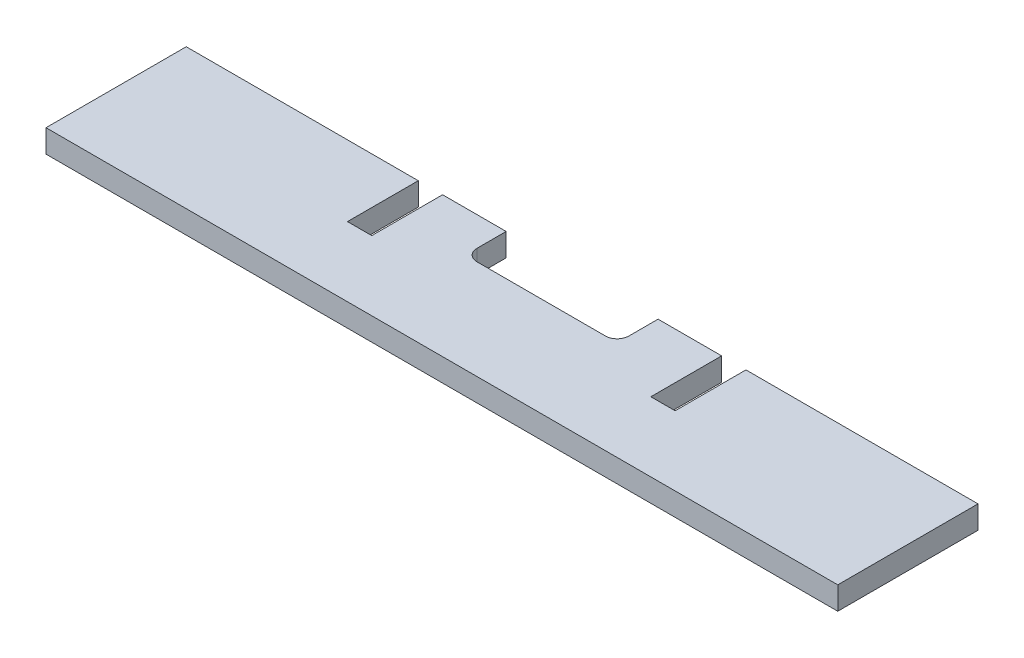
ISO-10303-21;
HEADER;
FILE_DESCRIPTION(('STEP AP214'),'2;1');
FILE_NAME('part.step','',(''),(''),'','','');
FILE_SCHEMA(('AUTOMOTIVE_DESIGN { 1 0 10303 214 1 1 1 1 }'));
ENDSEC;
DATA;
#1=APPLICATION_CONTEXT('core data for automotive mechanical design processes');
#2=APPLICATION_PROTOCOL_DEFINITION('international standard','automotive_design',2000,#1);
#3=PRODUCT_CONTEXT('',#1,'mechanical');
#4=PRODUCT('Part','Part','',(#3));
#5=PRODUCT_RELATED_PRODUCT_CATEGORY('part','',(#4));
#6=PRODUCT_DEFINITION_FORMATION('','',#4);
#7=PRODUCT_DEFINITION_CONTEXT('part definition',#1,'design');
#8=PRODUCT_DEFINITION('design','',#6,#7);
#9=PRODUCT_DEFINITION_SHAPE('','',#8);
#10=(LENGTH_UNIT() NAMED_UNIT(*) SI_UNIT(.MILLI.,.METRE.));
#11=(NAMED_UNIT(*) PLANE_ANGLE_UNIT() SI_UNIT($,.RADIAN.));
#12=(NAMED_UNIT(*) SI_UNIT($,.STERADIAN.) SOLID_ANGLE_UNIT());
#13=UNCERTAINTY_MEASURE_WITH_UNIT(LENGTH_MEASURE(1.E-05),#10,'distance_accuracy_value','');
#14=(GEOMETRIC_REPRESENTATION_CONTEXT(3) GLOBAL_UNCERTAINTY_ASSIGNED_CONTEXT((#13)) GLOBAL_UNIT_ASSIGNED_CONTEXT((#10,
#11,#12)) REPRESENTATION_CONTEXT('',''));
#15=CARTESIAN_POINT('',(0.,0.,0.));
#16=DIRECTION('',(0.,0.,1.));
#17=DIRECTION('',(1.,0.,0.));
#18=AXIS2_PLACEMENT_3D('',#15,#16,#17);
#19=CARTESIAN_POINT('',(4423.78804568099,847.725,0.));
#20=DIRECTION('',(0.,0.,1.));
#21=DIRECTION('',(1.,0.,0.));
#22=AXIS2_PLACEMENT_3D('',#19,#20,#21);
#23=PLANE('',#22);
#24=DIRECTION('',(0.,1.,0.));
#25=VECTOR('',#24,1.);
#26=CARTESIAN_POINT('',(-41.275,-2295.26058781173,0.));
#27=LINE('',#26,#25);
#28=CARTESIAN_POINT('',(-41.275,841.502,0.));
#29=VERTEX_POINT('',#28);
#30=CARTESIAN_POINT('',(-41.275,853.948,0.));
#31=VERTEX_POINT('',#30);
#32=EDGE_CURVE('E186',#29,#31,#27,.T.);
#33=ORIENTED_EDGE('',*,*,#32,.F.);
#34=DIRECTION('',(-1.,0.,0.));
#35=VECTOR('',#34,1.);
#36=CARTESIAN_POINT('',(4423.78804568099,841.502,0.));
#37=LINE('',#36,#35);
#38=CARTESIAN_POINT('',(-75.819,841.502,0.));
#39=VERTEX_POINT('',#38);
#40=EDGE_CURVE('E198',#29,#39,#37,.T.);
#41=ORIENTED_EDGE('',*,*,#40,.T.);
#42=DIRECTION('',(0.,-1.,0.));
#43=VECTOR('',#42,1.);
#44=CARTESIAN_POINT('',(-75.819,847.725,0.));
#45=LINE('',#44,#43);
#46=CARTESIAN_POINT('',(-75.819,853.948,0.));
#47=VERTEX_POINT('',#46);
#48=EDGE_CURVE('E347',#47,#39,#45,.T.);
#49=ORIENTED_EDGE('',*,*,#48,.F.);
#50=DIRECTION('',(-1.,0.,0.));
#51=VECTOR('',#50,1.);
#52=CARTESIAN_POINT('',(4423.78804568099,853.948,0.));
#53=LINE('',#52,#51);
#54=EDGE_CURVE('E200',#31,#47,#53,.T.);
#55=ORIENTED_EDGE('',*,*,#54,.F.);
#56=EDGE_LOOP('',(#33,#41,#49,#55));
#57=FACE_BOUND('',#56,.T.);
#58=ADVANCED_FACE('F16',(#57),#23,.F.);
#59=CARTESIAN_POINT('',(4423.78804568099,853.948,38.1));
#60=DIRECTION('',(0.,-1.,0.));
#61=DIRECTION('',(0.,0.,-1.));
#62=AXIS2_PLACEMENT_3D('',#59,#60,#61);
#63=PLANE('',#62);
#64=DIRECTION('',(0.,0.,-1.));
#65=VECTOR('',#64,1.);
#66=CARTESIAN_POINT('',(41.275,853.948,38.0999999999987));
#67=LINE('',#66,#65);
#68=CARTESIAN_POINT('',(41.275,853.948,15.875));
#69=VERTEX_POINT('',#68);
#70=CARTESIAN_POINT('',(41.275,853.948,0.));
#71=VERTEX_POINT('',#70);
#72=EDGE_CURVE('E318',#69,#71,#67,.T.);
#73=ORIENTED_EDGE('',*,*,#72,.F.);
#74=CARTESIAN_POINT('',(34.925,853.948,15.875));
#75=DIRECTION('',(0.,-1.,0.));
#76=DIRECTION('',(0.,0.,-1.));
#77=AXIS2_PLACEMENT_3D('',#74,#75,#76);
#78=CIRCLE('',#77,6.35);
#79=CARTESIAN_POINT('',(34.925,853.948,22.225));
#80=VERTEX_POINT('',#79);
#81=EDGE_CURVE('E25',#69,#80,#78,.T.);
#82=ORIENTED_EDGE('',*,*,#81,.T.);
#83=DIRECTION('',(-1.,0.,0.));
#84=VECTOR('',#83,1.);
#85=CARTESIAN_POINT('',(4423.78804568099,853.948,22.2250000000005));
#86=LINE('',#85,#84);
#87=CARTESIAN_POINT('',(-34.925,853.948,22.225));
#88=VERTEX_POINT('',#87);
#89=EDGE_CURVE('E316',#80,#88,#86,.T.);
#90=ORIENTED_EDGE('',*,*,#89,.T.);
#91=CARTESIAN_POINT('',(-34.925,853.948,15.875));
#92=DIRECTION('',(0.,-1.,0.));
#93=DIRECTION('',(0.,0.,-1.));
#94=AXIS2_PLACEMENT_3D('',#91,#92,#93);
#95=CIRCLE('',#94,6.35);
#96=CARTESIAN_POINT('',(-41.275,853.948,15.875));
#97=VERTEX_POINT('',#96);
#98=EDGE_CURVE('E302',#88,#97,#95,.T.);
#99=ORIENTED_EDGE('',*,*,#98,.T.);
#100=DIRECTION('',(0.,0.,-1.));
#101=VECTOR('',#100,1.);
#102=CARTESIAN_POINT('',(-41.275,853.948,38.0999999999987));
#103=LINE('',#102,#101);
#104=EDGE_CURVE('E323',#97,#31,#103,.T.);
#105=ORIENTED_EDGE('',*,*,#104,.T.);
#106=ORIENTED_EDGE('',*,*,#54,.T.);
#107=DIRECTION('',(0.,0.,-1.));
#108=VECTOR('',#107,1.);
#109=CARTESIAN_POINT('',(-75.819,853.948,38.1));
#110=LINE('',#109,#108);
#111=CARTESIAN_POINT('',(-75.819,853.948,38.481));
#112=VERTEX_POINT('',#111);
#113=EDGE_CURVE('E269',#112,#47,#110,.T.);
#114=ORIENTED_EDGE('',*,*,#113,.F.);
#115=DIRECTION('',(1.,0.,0.));
#116=VECTOR('',#115,1.);
#117=CARTESIAN_POINT('',(4423.78804568099,853.948,38.4810000000005));
#118=LINE('',#117,#116);
#119=CARTESIAN_POINT('',(-89.027,853.948,38.481));
#120=VERTEX_POINT('',#119);
#121=EDGE_CURVE('E266',#120,#112,#118,.T.);
#122=ORIENTED_EDGE('',*,*,#121,.F.);
#123=DIRECTION('',(0.,0.,1.));
#124=VECTOR('',#123,1.);
#125=CARTESIAN_POINT('',(-89.027,853.948,38.1));
#126=LINE('',#125,#124);
#127=CARTESIAN_POINT('',(-89.027,853.948,0.));
#128=VERTEX_POINT('',#127);
#129=EDGE_CURVE('E273',#128,#120,#126,.T.);
#130=ORIENTED_EDGE('',*,*,#129,.F.);
#131=CARTESIAN_POINT('',(-215.10625,853.948,0.));
#132=VERTEX_POINT('',#131);
#133=EDGE_CURVE('E352',#128,#132,#53,.T.);
#134=ORIENTED_EDGE('',*,*,#133,.T.);
#135=DIRECTION('',(0.,0.,1.));
#136=VECTOR('',#135,1.);
#137=CARTESIAN_POINT('',(-215.10625,853.948,38.1));
#138=LINE('',#137,#136);
#139=CARTESIAN_POINT('',(-215.10625,853.948,76.2));
#140=VERTEX_POINT('',#139);
#141=EDGE_CURVE('E234',#132,#140,#138,.T.);
#142=ORIENTED_EDGE('',*,*,#141,.T.);
#143=DIRECTION('',(-1.,0.,0.));
#144=VECTOR('',#143,1.);
#145=CARTESIAN_POINT('',(4423.78804568099,853.948,76.2));
#146=LINE('',#145,#144);
#147=CARTESIAN_POINT('',(215.10625,853.948,76.2));
#148=VERTEX_POINT('',#147);
#149=EDGE_CURVE('E344',#148,#140,#146,.T.);
#150=ORIENTED_EDGE('',*,*,#149,.F.);
#151=DIRECTION('',(0.,0.,-1.));
#152=VECTOR('',#151,1.);
#153=CARTESIAN_POINT('',(215.10625,853.948,38.1));
#154=LINE('',#153,#152);
#155=CARTESIAN_POINT('',(215.10625,853.948,0.));
#156=VERTEX_POINT('',#155);
#157=EDGE_CURVE('E255',#148,#156,#154,.T.);
#158=ORIENTED_EDGE('',*,*,#157,.T.);
#159=CARTESIAN_POINT('',(89.027,853.948,0.));
#160=VERTEX_POINT('',#159);
#161=EDGE_CURVE('E219',#156,#160,#53,.T.);
#162=ORIENTED_EDGE('',*,*,#161,.T.);
#163=DIRECTION('',(0.,0.,-1.));
#164=VECTOR('',#163,1.);
#165=CARTESIAN_POINT('',(89.027,853.948,38.1));
#166=LINE('',#165,#164);
#167=CARTESIAN_POINT('',(89.027,853.948,38.481));
#168=VERTEX_POINT('',#167);
#169=EDGE_CURVE('E283',#168,#160,#166,.T.);
#170=ORIENTED_EDGE('',*,*,#169,.F.);
#171=DIRECTION('',(1.,0.,0.));
#172=VECTOR('',#171,1.);
#173=CARTESIAN_POINT('',(4423.78804568099,853.948,38.4810000000005));
#174=LINE('',#173,#172);
#175=CARTESIAN_POINT('',(75.819,853.948,38.481));
#176=VERTEX_POINT('',#175);
#177=EDGE_CURVE('E280',#176,#168,#174,.T.);
#178=ORIENTED_EDGE('',*,*,#177,.F.);
#179=DIRECTION('',(0.,0.,1.));
#180=VECTOR('',#179,1.);
#181=CARTESIAN_POINT('',(75.819,853.948,38.1));
#182=LINE('',#181,#180);
#183=CARTESIAN_POINT('',(75.819,853.948,0.));
#184=VERTEX_POINT('',#183);
#185=EDGE_CURVE('E277',#184,#176,#182,.T.);
#186=ORIENTED_EDGE('',*,*,#185,.F.);
#187=EDGE_CURVE('E335',#184,#71,#53,.T.);
#188=ORIENTED_EDGE('',*,*,#187,.T.);
#189=EDGE_LOOP('',(#73,#82,#90,#99,#105,#106,#114,#122,#130,#134,#142,#150,#158,#162,#170,#178,
#186,#188));
#190=FACE_BOUND('',#189,.T.);
#191=ADVANCED_FACE('F315',(#190),#63,.F.);
#192=CARTESIAN_POINT('',(4423.78804568099,841.502,38.1));
#193=DIRECTION('',(0.,1.,0.));
#194=DIRECTION('',(0.,0.,1.));
#195=AXIS2_PLACEMENT_3D('',#192,#193,#194);
#196=PLANE('',#195);
#197=DIRECTION('',(0.,0.,1.));
#198=VECTOR('',#197,1.);
#199=CARTESIAN_POINT('',(41.275,841.502,38.0999999999987));
#200=LINE('',#199,#198);
#201=CARTESIAN_POINT('',(41.275,841.502,0.));
#202=VERTEX_POINT('',#201);
#203=CARTESIAN_POINT('',(41.275,841.502,15.875));
#204=VERTEX_POINT('',#203);
#205=EDGE_CURVE('E193',#202,#204,#200,.T.);
#206=ORIENTED_EDGE('',*,*,#205,.F.);
#207=CARTESIAN_POINT('',(75.819,841.502,0.));
#208=VERTEX_POINT('',#207);
#209=EDGE_CURVE('E210',#208,#202,#37,.T.);
#210=ORIENTED_EDGE('',*,*,#209,.F.);
#211=DIRECTION('',(0.,0.,1.));
#212=VECTOR('',#211,1.);
#213=CARTESIAN_POINT('',(75.819,841.502,38.1));
#214=LINE('',#213,#212);
#215=CARTESIAN_POINT('',(75.819,841.502,38.481));
#216=VERTEX_POINT('',#215);
#217=EDGE_CURVE('E399',#208,#216,#214,.T.);
#218=ORIENTED_EDGE('',*,*,#217,.T.);
#219=DIRECTION('',(1.,0.,0.));
#220=VECTOR('',#219,1.);
#221=CARTESIAN_POINT('',(0.,841.502,38.481));
#222=LINE('',#221,#220);
#223=CARTESIAN_POINT('',(89.027,841.502,38.481));
#224=VERTEX_POINT('',#223);
#225=EDGE_CURVE('E396',#216,#224,#222,.T.);
#226=ORIENTED_EDGE('',*,*,#225,.T.);
#227=DIRECTION('',(0.,0.,-1.));
#228=VECTOR('',#227,1.);
#229=CARTESIAN_POINT('',(89.027,841.502,38.1));
#230=LINE('',#229,#228);
#231=CARTESIAN_POINT('',(89.027,841.502,0.));
#232=VERTEX_POINT('',#231);
#233=EDGE_CURVE('E393',#224,#232,#230,.T.);
#234=ORIENTED_EDGE('',*,*,#233,.T.);
#235=CARTESIAN_POINT('',(215.10625,841.502,0.));
#236=VERTEX_POINT('',#235);
#237=EDGE_CURVE('E213',#236,#232,#37,.T.);
#238=ORIENTED_EDGE('',*,*,#237,.F.);
#239=DIRECTION('',(0.,0.,1.));
#240=VECTOR('',#239,1.);
#241=CARTESIAN_POINT('',(215.10625,841.502,38.1));
#242=LINE('',#241,#240);
#243=CARTESIAN_POINT('',(215.10625,841.502,76.2));
#244=VERTEX_POINT('',#243);
#245=EDGE_CURVE('E264',#236,#244,#242,.T.);
#246=ORIENTED_EDGE('',*,*,#245,.T.);
#247=DIRECTION('',(-1.,0.,0.));
#248=VECTOR('',#247,1.);
#249=CARTESIAN_POINT('',(4423.78804568099,841.502,76.2));
#250=LINE('',#249,#248);
#251=CARTESIAN_POINT('',(-215.10625,841.502,76.2));
#252=VERTEX_POINT('',#251);
#253=EDGE_CURVE('E224',#244,#252,#250,.T.);
#254=ORIENTED_EDGE('',*,*,#253,.T.);
#255=DIRECTION('',(0.,0.,-1.));
#256=VECTOR('',#255,1.);
#257=CARTESIAN_POINT('',(-215.10625,841.502,38.1));
#258=LINE('',#257,#256);
#259=CARTESIAN_POINT('',(-215.10625,841.502,0.));
#260=VERTEX_POINT('',#259);
#261=EDGE_CURVE('E249',#252,#260,#258,.T.);
#262=ORIENTED_EDGE('',*,*,#261,.T.);
#263=CARTESIAN_POINT('',(-89.027,841.502,0.));
#264=VERTEX_POINT('',#263);
#265=EDGE_CURVE('E211',#264,#260,#37,.T.);
#266=ORIENTED_EDGE('',*,*,#265,.F.);
#267=DIRECTION('',(0.,0.,1.));
#268=VECTOR('',#267,1.);
#269=CARTESIAN_POINT('',(-89.027,841.502,38.1));
#270=LINE('',#269,#268);
#271=CARTESIAN_POINT('',(-89.027,841.502,38.481));
#272=VERTEX_POINT('',#271);
#273=EDGE_CURVE('E410',#264,#272,#270,.T.);
#274=ORIENTED_EDGE('',*,*,#273,.T.);
#275=DIRECTION('',(1.,0.,0.));
#276=VECTOR('',#275,1.);
#277=CARTESIAN_POINT('',(0.,841.502,38.481));
#278=LINE('',#277,#276);
#279=CARTESIAN_POINT('',(-75.819,841.502,38.481));
#280=VERTEX_POINT('',#279);
#281=EDGE_CURVE('E416',#272,#280,#278,.T.);
#282=ORIENTED_EDGE('',*,*,#281,.T.);
#283=DIRECTION('',(0.,0.,-1.));
#284=VECTOR('',#283,1.);
#285=CARTESIAN_POINT('',(-75.819,841.502,38.1));
#286=LINE('',#285,#284);
#287=EDGE_CURVE('E208',#280,#39,#286,.T.);
#288=ORIENTED_EDGE('',*,*,#287,.T.);
#289=ORIENTED_EDGE('',*,*,#40,.F.);
#290=DIRECTION('',(0.,0.,1.));
#291=VECTOR('',#290,1.);
#292=CARTESIAN_POINT('',(-41.275,841.502,38.0999999999987));
#293=LINE('',#292,#291);
#294=CARTESIAN_POINT('',(-41.275,841.502,15.875));
#295=VERTEX_POINT('',#294);
#296=EDGE_CURVE('E182',#29,#295,#293,.T.);
#297=ORIENTED_EDGE('',*,*,#296,.T.);
#298=CARTESIAN_POINT('',(-34.925,841.502,15.875));
#299=DIRECTION('',(0.,1.,0.));
#300=DIRECTION('',(0.,0.,1.));
#301=AXIS2_PLACEMENT_3D('',#298,#299,#300);
#302=CIRCLE('',#301,6.35);
#303=CARTESIAN_POINT('',(-34.925,841.502,22.225));
#304=VERTEX_POINT('',#303);
#305=EDGE_CURVE('E305',#295,#304,#302,.T.);
#306=ORIENTED_EDGE('',*,*,#305,.T.);
#307=DIRECTION('',(1.,0.,0.));
#308=VECTOR('',#307,1.);
#309=CARTESIAN_POINT('',(4423.78804568099,841.502,22.2250000000005));
#310=LINE('',#309,#308);
#311=CARTESIAN_POINT('',(34.925,841.502,22.225));
#312=VERTEX_POINT('',#311);
#313=EDGE_CURVE('E194',#304,#312,#310,.T.);
#314=ORIENTED_EDGE('',*,*,#313,.T.);
#315=CARTESIAN_POINT('',(34.925,841.502,15.875));
#316=DIRECTION('',(0.,1.,0.));
#317=DIRECTION('',(0.,0.,1.));
#318=AXIS2_PLACEMENT_3D('',#315,#316,#317);
#319=CIRCLE('',#318,6.35);
#320=EDGE_CURVE('E11',#312,#204,#319,.T.);
#321=ORIENTED_EDGE('',*,*,#320,.T.);
#322=EDGE_LOOP('',(#206,#210,#218,#226,#234,#238,#246,#254,#262,#266,#274,#282,#288,#289,#297,
#306,#314,#321));
#323=FACE_BOUND('',#322,.T.);
#324=ADVANCED_FACE('F205',(#323),#196,.F.);
#325=DIRECTION('',(0.,-1.,0.));
#326=VECTOR('',#325,1.);
#327=CARTESIAN_POINT('',(89.027,847.725,0.));
#328=LINE('',#327,#326);
#329=EDGE_CURVE('E339',#160,#232,#328,.T.);
#330=ORIENTED_EDGE('',*,*,#329,.F.);
#331=ORIENTED_EDGE('',*,*,#161,.F.);
#332=DIRECTION('',(0.,-1.,0.));
#333=VECTOR('',#332,1.);
#334=CARTESIAN_POINT('',(215.10625,847.725,0.));
#335=LINE('',#334,#333);
#336=EDGE_CURVE('E258',#156,#236,#335,.T.);
#337=ORIENTED_EDGE('',*,*,#336,.T.);
#338=ORIENTED_EDGE('',*,*,#237,.T.);
#339=EDGE_LOOP('',(#330,#331,#337,#338));
#340=FACE_BOUND('',#339,.T.);
#341=ADVANCED_FACE('F387',(#340),#23,.F.);
#342=ORIENTED_EDGE('',*,*,#209,.T.);
#343=DIRECTION('',(0.,1.,0.));
#344=VECTOR('',#343,1.);
#345=CARTESIAN_POINT('',(41.275,-2295.26058781173,0.));
#346=LINE('',#345,#344);
#347=EDGE_CURVE('E202',#202,#71,#346,.T.);
#348=ORIENTED_EDGE('',*,*,#347,.T.);
#349=ORIENTED_EDGE('',*,*,#187,.F.);
#350=DIRECTION('',(0.,1.,0.));
#351=VECTOR('',#350,1.);
#352=CARTESIAN_POINT('',(75.819,847.725,0.));
#353=LINE('',#352,#351);
#354=EDGE_CURVE('E334',#208,#184,#353,.T.);
#355=ORIENTED_EDGE('',*,*,#354,.F.);
#356=EDGE_LOOP('',(#342,#348,#349,#355));
#357=FACE_BOUND('',#356,.T.);
#358=ADVANCED_FACE('F332',(#357),#23,.F.);
#359=DIRECTION('',(0.,1.,0.));
#360=VECTOR('',#359,1.);
#361=CARTESIAN_POINT('',(-89.027,847.725,0.));
#362=LINE('',#361,#360);
#363=EDGE_CURVE('E340',#264,#128,#362,.T.);
#364=ORIENTED_EDGE('',*,*,#363,.F.);
#365=ORIENTED_EDGE('',*,*,#265,.T.);
#366=DIRECTION('',(0.,1.,0.));
#367=VECTOR('',#366,1.);
#368=CARTESIAN_POINT('',(-215.10625,847.725,0.));
#369=LINE('',#368,#367);
#370=EDGE_CURVE('E243',#260,#132,#369,.T.);
#371=ORIENTED_EDGE('',*,*,#370,.T.);
#372=ORIENTED_EDGE('',*,*,#133,.F.);
#373=EDGE_LOOP('',(#364,#365,#371,#372));
#374=FACE_BOUND('',#373,.T.);
#375=ADVANCED_FACE('F374',(#374),#23,.F.);
#376=CARTESIAN_POINT('',(215.10625,946.15,76.2));
#377=DIRECTION('',(-1.,0.,0.));
#378=DIRECTION('',(0.,1.,0.));
#379=AXIS2_PLACEMENT_3D('',#376,#377,#378);
#380=PLANE('',#379);
#381=ORIENTED_EDGE('',*,*,#336,.F.);
#382=ORIENTED_EDGE('',*,*,#157,.F.);
#383=DIRECTION('',(0.,1.,0.));
#384=VECTOR('',#383,1.);
#385=CARTESIAN_POINT('',(215.10625,847.725,76.2));
#386=LINE('',#385,#384);
#387=EDGE_CURVE('E261',#244,#148,#386,.T.);
#388=ORIENTED_EDGE('',*,*,#387,.F.);
#389=ORIENTED_EDGE('',*,*,#245,.F.);
#390=EDGE_LOOP('',(#381,#382,#388,#389));
#391=FACE_BOUND('',#390,.T.);
#392=ADVANCED_FACE('F386',(#391),#380,.F.);
#393=CARTESIAN_POINT('',(-215.10625,946.15,76.2));
#394=DIRECTION('',(1.,0.,0.));
#395=DIRECTION('',(0.,1.,0.));
#396=AXIS2_PLACEMENT_3D('',#393,#394,#395);
#397=PLANE('',#396);
#398=ORIENTED_EDGE('',*,*,#141,.F.);
#399=ORIENTED_EDGE('',*,*,#370,.F.);
#400=ORIENTED_EDGE('',*,*,#261,.F.);
#401=DIRECTION('',(0.,-1.,0.));
#402=VECTOR('',#401,1.);
#403=CARTESIAN_POINT('',(-215.10625,847.725,76.2));
#404=LINE('',#403,#402);
#405=EDGE_CURVE('E252',#140,#252,#404,.T.);
#406=ORIENTED_EDGE('',*,*,#405,.F.);
#407=EDGE_LOOP('',(#398,#399,#400,#406));
#408=FACE_BOUND('',#407,.T.);
#409=ADVANCED_FACE('F379',(#408),#397,.F.);
#410=CARTESIAN_POINT('',(4423.78804568099,847.725,76.2));
#411=DIRECTION('',(0.,0.,-1.));
#412=DIRECTION('',(-1.,0.,0.));
#413=AXIS2_PLACEMENT_3D('',#410,#411,#412);
#414=PLANE('',#413);
#415=ORIENTED_EDGE('',*,*,#253,.F.);
#416=ORIENTED_EDGE('',*,*,#387,.T.);
#417=ORIENTED_EDGE('',*,*,#149,.T.);
#418=ORIENTED_EDGE('',*,*,#405,.T.);
#419=EDGE_LOOP('',(#415,#416,#417,#418));
#420=FACE_BOUND('',#419,.T.);
#421=ADVANCED_FACE('F381',(#420),#414,.F.);
#422=CARTESIAN_POINT('',(-89.027,4406.76258781172,38.1));
#423=DIRECTION('',(1.,0.,0.));
#424=DIRECTION('',(0.,0.,-1.));
#425=AXIS2_PLACEMENT_3D('',#422,#423,#424);
#426=PLANE('',#425);
#427=ORIENTED_EDGE('',*,*,#363,.T.);
#428=ORIENTED_EDGE('',*,*,#129,.T.);
#429=DIRECTION('',(0.,-1.,0.));
#430=VECTOR('',#429,1.);
#431=CARTESIAN_POINT('',(-89.027,4406.76258781172,38.481));
#432=LINE('',#431,#430);
#433=EDGE_CURVE('E419',#120,#272,#432,.T.);
#434=ORIENTED_EDGE('',*,*,#433,.T.);
#435=ORIENTED_EDGE('',*,*,#273,.F.);
#436=EDGE_LOOP('',(#427,#428,#434,#435));
#437=FACE_BOUND('',#436,.T.);
#438=ADVANCED_FACE('F432',(#437),#426,.T.);
#439=CARTESIAN_POINT('',(-75.819,4406.76258781172,38.1));
#440=DIRECTION('',(-1.,0.,0.));
#441=DIRECTION('',(0.,0.,1.));
#442=AXIS2_PLACEMENT_3D('',#439,#440,#441);
#443=PLANE('',#442);
#444=ORIENTED_EDGE('',*,*,#48,.T.);
#445=ORIENTED_EDGE('',*,*,#287,.F.);
#446=DIRECTION('',(0.,-1.,0.));
#447=VECTOR('',#446,1.);
#448=CARTESIAN_POINT('',(-75.819,4406.76258781172,38.481));
#449=LINE('',#448,#447);
#450=EDGE_CURVE('E421',#112,#280,#449,.T.);
#451=ORIENTED_EDGE('',*,*,#450,.F.);
#452=ORIENTED_EDGE('',*,*,#113,.T.);
#453=EDGE_LOOP('',(#444,#445,#451,#452));
#454=FACE_BOUND('',#453,.T.);
#455=ADVANCED_FACE('F426',(#454),#443,.T.);
#456=CARTESIAN_POINT('',(0.,4406.76258781172,38.481));
#457=DIRECTION('',(0.,0.,-1.));
#458=DIRECTION('',(-1.,0.,0.));
#459=AXIS2_PLACEMENT_3D('',#456,#457,#458);
#460=PLANE('',#459);
#461=ORIENTED_EDGE('',*,*,#121,.T.);
#462=ORIENTED_EDGE('',*,*,#450,.T.);
#463=ORIENTED_EDGE('',*,*,#281,.F.);
#464=ORIENTED_EDGE('',*,*,#433,.F.);
#465=EDGE_LOOP('',(#461,#462,#463,#464));
#466=FACE_BOUND('',#465,.T.);
#467=ADVANCED_FACE('F429',(#466),#460,.T.);
#468=CARTESIAN_POINT('',(89.027,4406.76258781172,38.1));
#469=DIRECTION('',(-1.,0.,0.));
#470=DIRECTION('',(0.,0.,1.));
#471=AXIS2_PLACEMENT_3D('',#468,#469,#470);
#472=PLANE('',#471);
#473=ORIENTED_EDGE('',*,*,#329,.T.);
#474=ORIENTED_EDGE('',*,*,#233,.F.);
#475=DIRECTION('',(0.,-1.,0.));
#476=VECTOR('',#475,1.);
#477=CARTESIAN_POINT('',(89.027,4406.76258781172,38.481));
#478=LINE('',#477,#476);
#479=EDGE_CURVE('E403',#168,#224,#478,.T.);
#480=ORIENTED_EDGE('',*,*,#479,.F.);
#481=ORIENTED_EDGE('',*,*,#169,.T.);
#482=EDGE_LOOP('',(#473,#474,#480,#481));
#483=FACE_BOUND('',#482,.T.);
#484=ADVANCED_FACE('F391',(#483),#472,.T.);
#485=CARTESIAN_POINT('',(0.,4406.76258781172,38.481));
#486=DIRECTION('',(0.,0.,-1.));
#487=DIRECTION('',(-1.,0.,0.));
#488=AXIS2_PLACEMENT_3D('',#485,#486,#487);
#489=PLANE('',#488);
#490=ORIENTED_EDGE('',*,*,#177,.T.);
#491=ORIENTED_EDGE('',*,*,#479,.T.);
#492=ORIENTED_EDGE('',*,*,#225,.F.);
#493=DIRECTION('',(0.,-1.,0.));
#494=VECTOR('',#493,1.);
#495=CARTESIAN_POINT('',(75.819,4406.76258781172,38.481));
#496=LINE('',#495,#494);
#497=EDGE_CURVE('E398',#176,#216,#496,.T.);
#498=ORIENTED_EDGE('',*,*,#497,.F.);
#499=EDGE_LOOP('',(#490,#491,#492,#498));
#500=FACE_BOUND('',#499,.T.);
#501=ADVANCED_FACE('F621',(#500),#489,.T.);
#502=CARTESIAN_POINT('',(75.819,4406.76258781172,38.1));
#503=DIRECTION('',(1.,0.,0.));
#504=DIRECTION('',(0.,0.,-1.));
#505=AXIS2_PLACEMENT_3D('',#502,#503,#504);
#506=PLANE('',#505);
#507=ORIENTED_EDGE('',*,*,#354,.T.);
#508=ORIENTED_EDGE('',*,*,#185,.T.);
#509=ORIENTED_EDGE('',*,*,#497,.T.);
#510=ORIENTED_EDGE('',*,*,#217,.F.);
#511=EDGE_LOOP('',(#507,#508,#509,#510));
#512=FACE_BOUND('',#511,.T.);
#513=ADVANCED_FACE('F606',(#512),#506,.T.);
#514=CARTESIAN_POINT('',(41.275,-2295.26058781173,-5.53358328761521));
#515=DIRECTION('',(-1.,0.,0.));
#516=DIRECTION('',(0.,0.,1.));
#517=AXIS2_PLACEMENT_3D('',#514,#515,#516);
#518=PLANE('',#517);
#519=ORIENTED_EDGE('',*,*,#205,.T.);
#520=DIRECTION('',(0.,1.,0.));
#521=VECTOR('',#520,1.);
#522=CARTESIAN_POINT('',(41.275,-2295.26058781173,15.875));
#523=LINE('',#522,#521);
#524=EDGE_CURVE('E299',#204,#69,#523,.T.);
#525=ORIENTED_EDGE('',*,*,#524,.T.);
#526=ORIENTED_EDGE('',*,*,#72,.T.);
#527=ORIENTED_EDGE('',*,*,#347,.F.);
#528=EDGE_LOOP('',(#519,#525,#526,#527));
#529=FACE_BOUND('',#528,.T.);
#530=ADVANCED_FACE('F326',(#529),#518,.T.);
#531=CARTESIAN_POINT('',(-41.275,-2295.26058781173,-5.53358328761524));
#532=DIRECTION('',(-1.,0.,0.));
#533=DIRECTION('',(0.,0.,1.));
#534=AXIS2_PLACEMENT_3D('',#531,#532,#533);
#535=PLANE('',#534);
#536=ORIENTED_EDGE('',*,*,#104,.F.);
#537=DIRECTION('',(0.,1.,0.));
#538=VECTOR('',#537,1.);
#539=CARTESIAN_POINT('',(-41.275,841.502,15.875));
#540=LINE('',#539,#538);
#541=EDGE_CURVE('E189',#97,#295,#540,.F.);
#542=ORIENTED_EDGE('',*,*,#541,.T.);
#543=ORIENTED_EDGE('',*,*,#296,.F.);
#544=ORIENTED_EDGE('',*,*,#32,.T.);
#545=EDGE_LOOP('',(#536,#542,#543,#544));
#546=FACE_BOUND('',#545,.T.);
#547=ADVANCED_FACE('F185',(#546),#535,.F.);
#548=CARTESIAN_POINT('',(19.9758464336395,-2295.26058781173,22.225));
#549=DIRECTION('',(0.,0.,1.));
#550=DIRECTION('',(1.,0.,0.));
#551=AXIS2_PLACEMENT_3D('',#548,#549,#550);
#552=PLANE('',#551);
#553=ORIENTED_EDGE('',*,*,#313,.F.);
#554=DIRECTION('',(0.,1.,0.));
#555=VECTOR('',#554,1.);
#556=CARTESIAN_POINT('',(-34.925,853.948,22.225));
#557=LINE('',#556,#555);
#558=EDGE_CURVE('E293',#304,#88,#557,.T.);
#559=ORIENTED_EDGE('',*,*,#558,.T.);
#560=ORIENTED_EDGE('',*,*,#89,.F.);
#561=DIRECTION('',(0.,1.,0.));
#562=VECTOR('',#561,1.);
#563=CARTESIAN_POINT('',(34.925,-2295.26058781173,22.225));
#564=LINE('',#563,#562);
#565=EDGE_CURVE('E290',#80,#312,#564,.F.);
#566=ORIENTED_EDGE('',*,*,#565,.T.);
#567=EDGE_LOOP('',(#553,#559,#560,#566));
#568=FACE_BOUND('',#567,.T.);
#569=ADVANCED_FACE('F321',(#568),#552,.F.);
#570=CARTESIAN_POINT('',(-34.925,-2295.26058781173,15.875));
#571=DIRECTION('',(0.,-1.,0.));
#572=DIRECTION('',(0.,0.,-1.));
#573=AXIS2_PLACEMENT_3D('',#570,#571,#572);
#574=CYLINDRICAL_SURFACE('',#573,6.35);
#575=ORIENTED_EDGE('',*,*,#305,.F.);
#576=ORIENTED_EDGE('',*,*,#541,.F.);
#577=ORIENTED_EDGE('',*,*,#98,.F.);
#578=ORIENTED_EDGE('',*,*,#558,.F.);
#579=EDGE_LOOP('',(#575,#576,#577,#578));
#580=FACE_BOUND('',#579,.T.);
#581=ADVANCED_FACE('F463',(#580),#574,.F.);
#582=CARTESIAN_POINT('',(34.925,-2295.26058781173,15.875));
#583=DIRECTION('',(0.,1.,0.));
#584=DIRECTION('',(0.,0.,1.));
#585=AXIS2_PLACEMENT_3D('',#582,#583,#584);
#586=CYLINDRICAL_SURFACE('',#585,6.35);
#587=ORIENTED_EDGE('',*,*,#320,.F.);
#588=ORIENTED_EDGE('',*,*,#565,.F.);
#589=ORIENTED_EDGE('',*,*,#81,.F.);
#590=ORIENTED_EDGE('',*,*,#524,.F.);
#591=EDGE_LOOP('',(#587,#588,#589,#590));
#592=FACE_BOUND('',#591,.T.);
#593=ADVANCED_FACE('F18',(#592),#586,.F.);
#594=CLOSED_SHELL('',(#58,#191,#324,#341,#358,#375,#392,#409,#421,#438,#455,#467,#484,#501,#513,
#530,#547,#569,#581,#593));
#595=MANIFOLD_SOLID_BREP('B1',#594);
#596=ADVANCED_BREP_SHAPE_REPRESENTATION('',(#18,#595),#14);
#597=SHAPE_DEFINITION_REPRESENTATION(#9,#596);
ENDSEC;
END-ISO-10303-21;
